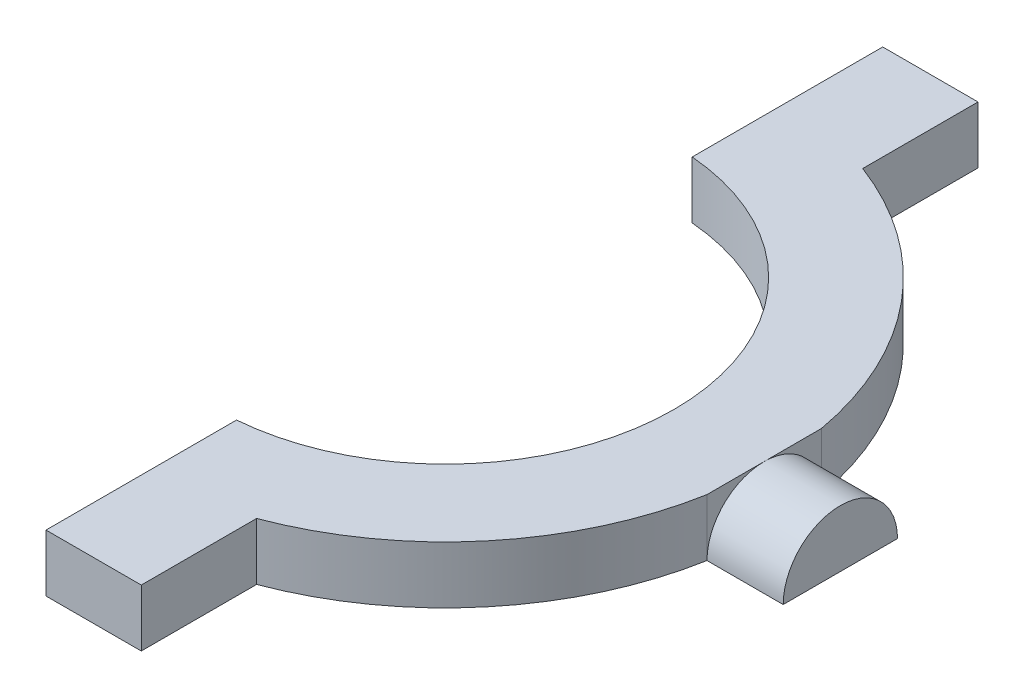
ISO-10303-21;
HEADER;
FILE_DESCRIPTION(('STEP AP214'),'2;1');
FILE_NAME('part.step','',(''),(''),'','','');
FILE_SCHEMA(('AUTOMOTIVE_DESIGN { 1 0 10303 214 1 1 1 1 }'));
ENDSEC;
DATA;
#1=APPLICATION_CONTEXT('core data for automotive mechanical design processes');
#2=APPLICATION_PROTOCOL_DEFINITION('international standard','automotive_design',2000,#1);
#3=PRODUCT_CONTEXT('',#1,'mechanical');
#4=PRODUCT('Part','Part','',(#3));
#5=PRODUCT_RELATED_PRODUCT_CATEGORY('part','',(#4));
#6=PRODUCT_DEFINITION_FORMATION('','',#4);
#7=PRODUCT_DEFINITION_CONTEXT('part definition',#1,'design');
#8=PRODUCT_DEFINITION('design','',#6,#7);
#9=PRODUCT_DEFINITION_SHAPE('','',#8);
#10=(LENGTH_UNIT() NAMED_UNIT(*) SI_UNIT(.MILLI.,.METRE.));
#11=(NAMED_UNIT(*) PLANE_ANGLE_UNIT() SI_UNIT($,.RADIAN.));
#12=(NAMED_UNIT(*) SI_UNIT($,.STERADIAN.) SOLID_ANGLE_UNIT());
#13=UNCERTAINTY_MEASURE_WITH_UNIT(LENGTH_MEASURE(1.E-05),#10,'distance_accuracy_value','');
#14=(GEOMETRIC_REPRESENTATION_CONTEXT(3) GLOBAL_UNCERTAINTY_ASSIGNED_CONTEXT((#13)) GLOBAL_UNIT_ASSIGNED_CONTEXT((#10,
#11,#12)) REPRESENTATION_CONTEXT('',''));
#15=CARTESIAN_POINT('',(0.,0.,0.));
#16=DIRECTION('',(0.,0.,1.));
#17=DIRECTION('',(1.,0.,0.));
#18=AXIS2_PLACEMENT_3D('',#15,#16,#17);
#19=CARTESIAN_POINT('',(41.466401061363,6.,6.));
#20=DIRECTION('',(-1.,0.,0.));
#21=DIRECTION('',(0.,0.,1.));
#22=AXIS2_PLACEMENT_3D('',#19,#20,#21);
#23=PLANE('',#22);
#24=CARTESIAN_POINT('',(41.466401061363,0.,0.));
#25=DIRECTION('',(1.,0.,0.));
#26=DIRECTION('',(0.,0.,-1.));
#27=AXIS2_PLACEMENT_3D('',#24,#25,#26);
#28=CIRCLE('',#27,6.);
#29=CARTESIAN_POINT('',(41.466401061363,0.,-6.));
#30=VERTEX_POINT('',#29);
#31=CARTESIAN_POINT('',(41.466401061363,0.,6.));
#32=VERTEX_POINT('',#31);
#33=EDGE_CURVE('E201',#30,#32,#28,.T.);
#34=ORIENTED_EDGE('',*,*,#33,.T.);
#35=DIRECTION('',(0.,0.,-1.));
#36=VECTOR('',#35,1.);
#37=CARTESIAN_POINT('',(41.466401061363,0.,6.));
#38=LINE('',#37,#36);
#39=EDGE_CURVE('E150',#32,#30,#38,.T.);
#40=ORIENTED_EDGE('',*,*,#39,.T.);
#41=EDGE_LOOP('',(#34,#40));
#42=FACE_BOUND('',#41,.T.);
#43=ADVANCED_FACE('F36',(#42),#23,.F.);
#44=CARTESIAN_POINT('',(0.,6.,0.));
#45=DIRECTION('',(0.,1.,0.));
#46=DIRECTION('',(0.,0.,1.));
#47=AXIS2_PLACEMENT_3D('',#44,#45,#46);
#48=PLANE('',#47);
#49=CARTESIAN_POINT('',(0.,6.,0.));
#50=DIRECTION('',(0.,1.,0.));
#51=DIRECTION('',(0.,0.,1.));
#52=AXIS2_PLACEMENT_3D('',#49,#50,#51);
#53=CIRCLE('',#52,34.);
#54=CARTESIAN_POINT('',(12.,6.,31.8119474411737));
#55=VERTEX_POINT('',#54);
#56=CARTESIAN_POINT('',(33.466401061363,6.,6.));
#57=VERTEX_POINT('',#56);
#58=EDGE_CURVE('E100',#55,#57,#53,.T.);
#59=ORIENTED_EDGE('',*,*,#58,.T.);
#60=DIRECTION('',(0.,0.,-1.));
#61=VECTOR('',#60,1.);
#62=CARTESIAN_POINT('',(33.466401061363,6.,0.));
#63=LINE('',#62,#61);
#64=CARTESIAN_POINT('',(33.466401061363,6.,0.));
#65=VERTEX_POINT('',#64);
#66=EDGE_CURVE('E144',#57,#65,#63,.T.);
#67=ORIENTED_EDGE('',*,*,#66,.T.);
#68=CARTESIAN_POINT('',(33.466401061363,6.,-5.99999999999998));
#69=VERTEX_POINT('',#68);
#70=EDGE_CURVE('E216',#65,#69,#63,.T.);
#71=ORIENTED_EDGE('',*,*,#70,.T.);
#72=CARTESIAN_POINT('',(0.,6.,0.));
#73=DIRECTION('',(0.,1.,0.));
#74=DIRECTION('',(0.,0.,1.));
#75=AXIS2_PLACEMENT_3D('',#72,#73,#74);
#76=CIRCLE('',#75,34.);
#77=CARTESIAN_POINT('',(12.,6.,-31.8119474411737));
#78=VERTEX_POINT('',#77);
#79=EDGE_CURVE('E221',#69,#78,#76,.T.);
#80=ORIENTED_EDGE('',*,*,#79,.T.);
#81=DIRECTION('',(0.,0.,-1.));
#82=VECTOR('',#81,1.);
#83=CARTESIAN_POINT('',(12.,6.,-43.9165214862028));
#84=LINE('',#83,#82);
#85=CARTESIAN_POINT('',(12.,6.,-43.9165214862028));
#86=VERTEX_POINT('',#85);
#87=EDGE_CURVE('E223',#78,#86,#84,.T.);
#88=ORIENTED_EDGE('',*,*,#87,.T.);
#89=DIRECTION('',(-1.,0.,0.));
#90=VECTOR('',#89,1.);
#91=CARTESIAN_POINT('',(1.99999999999999,6.,-43.9165214862028));
#92=LINE('',#91,#90);
#93=CARTESIAN_POINT('',(1.99999999999999,6.,-43.9165214862028));
#94=VERTEX_POINT('',#93);
#95=EDGE_CURVE('E225',#86,#94,#92,.T.);
#96=ORIENTED_EDGE('',*,*,#95,.T.);
#97=DIRECTION('',(0.,0.,1.));
#98=VECTOR('',#97,1.);
#99=CARTESIAN_POINT('',(1.99999999999999,6.,-43.9165214862028));
#100=LINE('',#99,#98);
#101=CARTESIAN_POINT('',(1.99999999999999,6.,-23.9165214862028));
#102=VERTEX_POINT('',#101);
#103=EDGE_CURVE('E122',#94,#102,#100,.T.);
#104=ORIENTED_EDGE('',*,*,#103,.T.);
#105=CARTESIAN_POINT('',(0.,6.,0.));
#106=DIRECTION('',(0.,-1.,0.));
#107=DIRECTION('',(0.,0.,1.));
#108=AXIS2_PLACEMENT_3D('',#105,#106,#107);
#109=CIRCLE('',#108,24.);
#110=CARTESIAN_POINT('',(2.,6.,23.9165214862028));
#111=VERTEX_POINT('',#110);
#112=EDGE_CURVE('E116',#102,#111,#109,.T.);
#113=ORIENTED_EDGE('',*,*,#112,.T.);
#114=DIRECTION('',(0.,0.,1.));
#115=VECTOR('',#114,1.);
#116=CARTESIAN_POINT('',(2.,6.,23.9165214862028));
#117=LINE('',#116,#115);
#118=CARTESIAN_POINT('',(2.00000000000001,6.,43.9165214862028));
#119=VERTEX_POINT('',#118);
#120=EDGE_CURVE('E120',#111,#119,#117,.T.);
#121=ORIENTED_EDGE('',*,*,#120,.T.);
#122=DIRECTION('',(1.,0.,0.));
#123=VECTOR('',#122,1.);
#124=CARTESIAN_POINT('',(2.00000000000001,6.,43.9165214862028));
#125=LINE('',#124,#123);
#126=CARTESIAN_POINT('',(12.,6.,43.9165214862028));
#127=VERTEX_POINT('',#126);
#128=EDGE_CURVE('E53',#119,#127,#125,.T.);
#129=ORIENTED_EDGE('',*,*,#128,.T.);
#130=DIRECTION('',(0.,0.,-1.));
#131=VECTOR('',#130,1.);
#132=CARTESIAN_POINT('',(12.,6.,43.9165214862028));
#133=LINE('',#132,#131);
#134=EDGE_CURVE('E167',#127,#55,#133,.T.);
#135=ORIENTED_EDGE('',*,*,#134,.T.);
#136=EDGE_LOOP('',(#59,#67,#71,#80,#88,#96,#104,#113,#121,#129,#135));
#137=FACE_BOUND('',#136,.T.);
#138=ADVANCED_FACE('F118',(#137),#48,.T.);
#139=CARTESIAN_POINT('',(12.,6.,43.9165214862028));
#140=DIRECTION('',(-1.,0.,0.));
#141=DIRECTION('',(0.,0.,1.));
#142=AXIS2_PLACEMENT_3D('',#139,#140,#141);
#143=PLANE('',#142);
#144=DIRECTION('',(0.,0.,-1.));
#145=VECTOR('',#144,1.);
#146=CARTESIAN_POINT('',(12.,0.,43.9165214862028));
#147=LINE('',#146,#145);
#148=CARTESIAN_POINT('',(12.,0.,43.9165214862028));
#149=VERTEX_POINT('',#148);
#150=CARTESIAN_POINT('',(12.,0.,31.8119474411737));
#151=VERTEX_POINT('',#150);
#152=EDGE_CURVE('E140',#149,#151,#147,.T.);
#153=ORIENTED_EDGE('',*,*,#152,.T.);
#154=DIRECTION('',(0.,-1.,0.));
#155=VECTOR('',#154,1.);
#156=CARTESIAN_POINT('',(12.,6.,31.8119474411737));
#157=LINE('',#156,#155);
#158=EDGE_CURVE('E12',#55,#151,#157,.T.);
#159=ORIENTED_EDGE('',*,*,#158,.F.);
#160=ORIENTED_EDGE('',*,*,#134,.F.);
#161=DIRECTION('',(0.,-1.,0.));
#162=VECTOR('',#161,1.);
#163=CARTESIAN_POINT('',(12.,6.,43.9165214862028));
#164=LINE('',#163,#162);
#165=EDGE_CURVE('E136',#127,#149,#164,.T.);
#166=ORIENTED_EDGE('',*,*,#165,.T.);
#167=EDGE_LOOP('',(#153,#159,#160,#166));
#168=FACE_BOUND('',#167,.T.);
#169=ADVANCED_FACE('F38',(#168),#143,.F.);
#170=CARTESIAN_POINT('',(0.,6.,0.));
#171=DIRECTION('',(0.,-1.,0.));
#172=DIRECTION('',(0.,0.,-1.));
#173=AXIS2_PLACEMENT_3D('',#170,#171,#172);
#174=CYLINDRICAL_SURFACE('',#173,34.);
#175=CARTESIAN_POINT('',(0.,0.,0.));
#176=DIRECTION('',(0.,1.,0.));
#177=DIRECTION('',(0.,0.,1.));
#178=AXIS2_PLACEMENT_3D('',#175,#176,#177);
#179=CIRCLE('',#178,34.);
#180=CARTESIAN_POINT('',(33.466401061363,0.,6.));
#181=VERTEX_POINT('',#180);
#182=EDGE_CURVE('E143',#151,#181,#179,.T.);
#183=ORIENTED_EDGE('',*,*,#182,.T.);
#184=DIRECTION('',(0.,-1.,0.));
#185=VECTOR('',#184,1.);
#186=CARTESIAN_POINT('',(33.466401061363,6.,6.));
#187=LINE('',#186,#185);
#188=EDGE_CURVE('E45',#57,#181,#187,.T.);
#189=ORIENTED_EDGE('',*,*,#188,.F.);
#190=ORIENTED_EDGE('',*,*,#58,.F.);
#191=ORIENTED_EDGE('',*,*,#158,.T.);
#192=EDGE_LOOP('',(#183,#189,#190,#191));
#193=FACE_BOUND('',#192,.T.);
#194=ADVANCED_FACE('F203',(#193),#174,.T.);
#195=CARTESIAN_POINT('',(0.,6.,0.));
#196=DIRECTION('',(0.,-1.,0.));
#197=DIRECTION('',(0.,0.,-1.));
#198=AXIS2_PLACEMENT_3D('',#195,#196,#197);
#199=CYLINDRICAL_SURFACE('',#198,34.);
#200=CARTESIAN_POINT('',(0.,0.,0.));
#201=DIRECTION('',(0.,1.,0.));
#202=DIRECTION('',(0.,0.,1.));
#203=AXIS2_PLACEMENT_3D('',#200,#201,#202);
#204=CIRCLE('',#203,34.);
#205=CARTESIAN_POINT('',(33.466401061363,0.,-6.));
#206=VERTEX_POINT('',#205);
#207=CARTESIAN_POINT('',(12.,0.,-31.8119474411737));
#208=VERTEX_POINT('',#207);
#209=EDGE_CURVE('E156',#206,#208,#204,.T.);
#210=ORIENTED_EDGE('',*,*,#209,.T.);
#211=DIRECTION('',(0.,-1.,0.));
#212=VECTOR('',#211,1.);
#213=CARTESIAN_POINT('',(12.,6.,-31.8119474411737));
#214=LINE('',#213,#212);
#215=EDGE_CURVE('E177',#78,#208,#214,.T.);
#216=ORIENTED_EDGE('',*,*,#215,.F.);
#217=ORIENTED_EDGE('',*,*,#79,.F.);
#218=DIRECTION('',(0.,-1.,0.));
#219=VECTOR('',#218,1.);
#220=CARTESIAN_POINT('',(33.466401061363,6.,-6.));
#221=LINE('',#220,#219);
#222=EDGE_CURVE('E180',#69,#206,#221,.T.);
#223=ORIENTED_EDGE('',*,*,#222,.T.);
#224=EDGE_LOOP('',(#210,#216,#217,#223));
#225=FACE_BOUND('',#224,.T.);
#226=ADVANCED_FACE('F254',(#225),#199,.T.);
#227=CARTESIAN_POINT('',(12.,6.,-43.9165214862028));
#228=DIRECTION('',(-1.,0.,0.));
#229=DIRECTION('',(0.,0.,1.));
#230=AXIS2_PLACEMENT_3D('',#227,#228,#229);
#231=PLANE('',#230);
#232=DIRECTION('',(0.,0.,-1.));
#233=VECTOR('',#232,1.);
#234=CARTESIAN_POINT('',(12.,0.,-43.9165214862028));
#235=LINE('',#234,#233);
#236=CARTESIAN_POINT('',(12.,0.,-43.9165214862028));
#237=VERTEX_POINT('',#236);
#238=EDGE_CURVE('E158',#208,#237,#235,.T.);
#239=ORIENTED_EDGE('',*,*,#238,.T.);
#240=DIRECTION('',(0.,-1.,0.));
#241=VECTOR('',#240,1.);
#242=CARTESIAN_POINT('',(12.,6.,-43.9165214862028));
#243=LINE('',#242,#241);
#244=EDGE_CURVE('E174',#86,#237,#243,.T.);
#245=ORIENTED_EDGE('',*,*,#244,.F.);
#246=ORIENTED_EDGE('',*,*,#87,.F.);
#247=ORIENTED_EDGE('',*,*,#215,.T.);
#248=EDGE_LOOP('',(#239,#245,#246,#247));
#249=FACE_BOUND('',#248,.T.);
#250=ADVANCED_FACE('F261',(#249),#231,.F.);
#251=CARTESIAN_POINT('',(1.99999999999999,6.,-43.9165214862028));
#252=DIRECTION('',(0.,0.,1.));
#253=DIRECTION('',(1.,0.,0.));
#254=AXIS2_PLACEMENT_3D('',#251,#252,#253);
#255=PLANE('',#254);
#256=DIRECTION('',(-1.,0.,0.));
#257=VECTOR('',#256,1.);
#258=CARTESIAN_POINT('',(1.99999999999999,0.,-43.9165214862028));
#259=LINE('',#258,#257);
#260=CARTESIAN_POINT('',(1.99999999999999,0.,-43.9165214862028));
#261=VERTEX_POINT('',#260);
#262=EDGE_CURVE('E160',#237,#261,#259,.T.);
#263=ORIENTED_EDGE('',*,*,#262,.T.);
#264=DIRECTION('',(0.,-1.,0.));
#265=VECTOR('',#264,1.);
#266=CARTESIAN_POINT('',(1.99999999999999,6.,-43.9165214862028));
#267=LINE('',#266,#265);
#268=EDGE_CURVE('E171',#94,#261,#267,.T.);
#269=ORIENTED_EDGE('',*,*,#268,.F.);
#270=ORIENTED_EDGE('',*,*,#95,.F.);
#271=ORIENTED_EDGE('',*,*,#244,.T.);
#272=EDGE_LOOP('',(#263,#269,#270,#271));
#273=FACE_BOUND('',#272,.T.);
#274=ADVANCED_FACE('F231',(#273),#255,.F.);
#275=CARTESIAN_POINT('',(1.99999999999999,6.,-43.9165214862028));
#276=DIRECTION('',(1.,0.,0.));
#277=DIRECTION('',(0.,0.,-1.));
#278=AXIS2_PLACEMENT_3D('',#275,#276,#277);
#279=PLANE('',#278);
#280=DIRECTION('',(0.,0.,1.));
#281=VECTOR('',#280,1.);
#282=CARTESIAN_POINT('',(1.99999999999999,0.,-43.9165214862028));
#283=LINE('',#282,#281);
#284=CARTESIAN_POINT('',(1.99999999999999,0.,-23.9165214862028));
#285=VERTEX_POINT('',#284);
#286=EDGE_CURVE('E162',#261,#285,#283,.T.);
#287=ORIENTED_EDGE('',*,*,#286,.T.);
#288=DIRECTION('',(0.,-1.,0.));
#289=VECTOR('',#288,1.);
#290=CARTESIAN_POINT('',(1.99999999999999,6.,-23.9165214862028));
#291=LINE('',#290,#289);
#292=EDGE_CURVE('E131',#102,#285,#291,.T.);
#293=ORIENTED_EDGE('',*,*,#292,.F.);
#294=ORIENTED_EDGE('',*,*,#103,.F.);
#295=ORIENTED_EDGE('',*,*,#268,.T.);
#296=EDGE_LOOP('',(#287,#293,#294,#295));
#297=FACE_BOUND('',#296,.T.);
#298=ADVANCED_FACE('F235',(#297),#279,.F.);
#299=CARTESIAN_POINT('',(0.,6.,0.));
#300=DIRECTION('',(0.,-1.,0.));
#301=DIRECTION('',(0.,0.,-1.));
#302=AXIS2_PLACEMENT_3D('',#299,#300,#301);
#303=CYLINDRICAL_SURFACE('',#302,24.);
#304=CARTESIAN_POINT('',(0.,0.,0.));
#305=DIRECTION('',(0.,-1.,0.));
#306=DIRECTION('',(0.,0.,1.));
#307=AXIS2_PLACEMENT_3D('',#304,#305,#306);
#308=CIRCLE('',#307,24.);
#309=CARTESIAN_POINT('',(2.,0.,23.9165214862028));
#310=VERTEX_POINT('',#309);
#311=EDGE_CURVE('E130',#285,#310,#308,.T.);
#312=ORIENTED_EDGE('',*,*,#311,.T.);
#313=DIRECTION('',(0.,-1.,0.));
#314=VECTOR('',#313,1.);
#315=CARTESIAN_POINT('',(2.,6.,23.9165214862028));
#316=LINE('',#315,#314);
#317=EDGE_CURVE('E127',#111,#310,#316,.T.);
#318=ORIENTED_EDGE('',*,*,#317,.F.);
#319=ORIENTED_EDGE('',*,*,#112,.F.);
#320=ORIENTED_EDGE('',*,*,#292,.T.);
#321=EDGE_LOOP('',(#312,#318,#319,#320));
#322=FACE_BOUND('',#321,.T.);
#323=ADVANCED_FACE('F128',(#322),#303,.F.);
#324=CARTESIAN_POINT('',(2.,6.,23.9165214862028));
#325=DIRECTION('',(1.,0.,0.));
#326=DIRECTION('',(0.,0.,-1.));
#327=AXIS2_PLACEMENT_3D('',#324,#325,#326);
#328=PLANE('',#327);
#329=DIRECTION('',(0.,0.,1.));
#330=VECTOR('',#329,1.);
#331=CARTESIAN_POINT('',(2.,0.,23.9165214862028));
#332=LINE('',#331,#330);
#333=CARTESIAN_POINT('',(2.00000000000001,0.,43.9165214862028));
#334=VERTEX_POINT('',#333);
#335=EDGE_CURVE('E86',#310,#334,#332,.T.);
#336=ORIENTED_EDGE('',*,*,#335,.T.);
#337=DIRECTION('',(0.,-1.,0.));
#338=VECTOR('',#337,1.);
#339=CARTESIAN_POINT('',(2.00000000000001,6.,43.9165214862028));
#340=LINE('',#339,#338);
#341=EDGE_CURVE('E132',#119,#334,#340,.T.);
#342=ORIENTED_EDGE('',*,*,#341,.F.);
#343=ORIENTED_EDGE('',*,*,#120,.F.);
#344=ORIENTED_EDGE('',*,*,#317,.T.);
#345=EDGE_LOOP('',(#336,#342,#343,#344));
#346=FACE_BOUND('',#345,.T.);
#347=ADVANCED_FACE('F134',(#346),#328,.F.);
#348=CARTESIAN_POINT('',(2.00000000000001,6.,43.9165214862028));
#349=DIRECTION('',(0.,0.,-1.));
#350=DIRECTION('',(-1.,0.,0.));
#351=AXIS2_PLACEMENT_3D('',#348,#349,#350);
#352=PLANE('',#351);
#353=DIRECTION('',(1.,0.,0.));
#354=VECTOR('',#353,1.);
#355=CARTESIAN_POINT('',(2.00000000000001,0.,43.9165214862028));
#356=LINE('',#355,#354);
#357=EDGE_CURVE('E92',#334,#149,#356,.T.);
#358=ORIENTED_EDGE('',*,*,#357,.T.);
#359=ORIENTED_EDGE('',*,*,#165,.F.);
#360=ORIENTED_EDGE('',*,*,#128,.F.);
#361=ORIENTED_EDGE('',*,*,#341,.T.);
#362=EDGE_LOOP('',(#358,#359,#360,#361));
#363=FACE_BOUND('',#362,.T.);
#364=ADVANCED_FACE('F238',(#363),#352,.F.);
#365=CARTESIAN_POINT('',(0.,0.,0.));
#366=DIRECTION('',(0.,1.,0.));
#367=DIRECTION('',(0.,0.,1.));
#368=AXIS2_PLACEMENT_3D('',#365,#366,#367);
#369=PLANE('',#368);
#370=DIRECTION('',(1.,0.,0.));
#371=VECTOR('',#370,1.);
#372=CARTESIAN_POINT('',(33.466401061363,0.,6.));
#373=LINE('',#372,#371);
#374=EDGE_CURVE('E147',#181,#32,#373,.T.);
#375=ORIENTED_EDGE('',*,*,#374,.F.);
#376=ORIENTED_EDGE('',*,*,#182,.F.);
#377=ORIENTED_EDGE('',*,*,#152,.F.);
#378=ORIENTED_EDGE('',*,*,#357,.F.);
#379=ORIENTED_EDGE('',*,*,#335,.F.);
#380=ORIENTED_EDGE('',*,*,#311,.F.);
#381=ORIENTED_EDGE('',*,*,#286,.F.);
#382=ORIENTED_EDGE('',*,*,#262,.F.);
#383=ORIENTED_EDGE('',*,*,#238,.F.);
#384=ORIENTED_EDGE('',*,*,#209,.F.);
#385=DIRECTION('',(-1.,0.,0.));
#386=VECTOR('',#385,1.);
#387=CARTESIAN_POINT('',(33.466401061363,0.,-6.));
#388=LINE('',#387,#386);
#389=EDGE_CURVE('E153',#30,#206,#388,.T.);
#390=ORIENTED_EDGE('',*,*,#389,.F.);
#391=ORIENTED_EDGE('',*,*,#39,.F.);
#392=EDGE_LOOP('',(#375,#376,#377,#378,#379,#380,#381,#382,#383,#384,#390,#391));
#393=FACE_BOUND('',#392,.T.);
#394=ADVANCED_FACE('F207',(#393),#369,.F.);
#395=CARTESIAN_POINT('',(33.466401061363,3.,0.));
#396=DIRECTION('',(1.,0.,0.));
#397=DIRECTION('',(0.,0.,-1.));
#398=AXIS2_PLACEMENT_3D('',#395,#396,#397);
#399=PLANE('',#398);
#400=ORIENTED_EDGE('',*,*,#188,.T.);
#401=CARTESIAN_POINT('',(33.466401061363,0.,0.));
#402=DIRECTION('',(1.,0.,0.));
#403=DIRECTION('',(0.,0.,-1.));
#404=AXIS2_PLACEMENT_3D('',#401,#402,#403);
#405=CIRCLE('',#404,6.);
#406=EDGE_CURVE('E190',#65,#181,#405,.T.);
#407=ORIENTED_EDGE('',*,*,#406,.F.);
#408=ORIENTED_EDGE('',*,*,#66,.F.);
#409=EDGE_LOOP('',(#400,#407,#408));
#410=FACE_BOUND('',#409,.T.);
#411=ADVANCED_FACE('F188',(#410),#399,.T.);
#412=ORIENTED_EDGE('',*,*,#222,.F.);
#413=ORIENTED_EDGE('',*,*,#70,.F.);
#414=EDGE_CURVE('E200',#206,#65,#405,.T.);
#415=ORIENTED_EDGE('',*,*,#414,.F.);
#416=EDGE_LOOP('',(#412,#413,#415));
#417=FACE_BOUND('',#416,.T.);
#418=ADVANCED_FACE('F300',(#417),#399,.T.);
#419=CARTESIAN_POINT('',(33.466401061363,0.,0.));
#420=DIRECTION('',(1.,0.,0.));
#421=DIRECTION('',(0.,0.,-1.));
#422=AXIS2_PLACEMENT_3D('',#419,#420,#421);
#423=CYLINDRICAL_SURFACE('',#422,6.);
#424=ORIENTED_EDGE('',*,*,#414,.T.);
#425=ORIENTED_EDGE('',*,*,#406,.T.);
#426=ORIENTED_EDGE('',*,*,#374,.T.);
#427=ORIENTED_EDGE('',*,*,#33,.F.);
#428=ORIENTED_EDGE('',*,*,#389,.T.);
#429=EDGE_LOOP('',(#424,#425,#426,#427,#428));
#430=FACE_BOUND('',#429,.T.);
#431=ADVANCED_FACE('F196',(#430),#423,.T.);
#432=CLOSED_SHELL('',(#43,#138,#169,#194,#226,#250,#274,#298,#323,#347,#364,#394,#411,#418,#431));
#433=MANIFOLD_SOLID_BREP('B2',#432);
#434=ADVANCED_BREP_SHAPE_REPRESENTATION('',(#18,#433),#14);
#435=SHAPE_DEFINITION_REPRESENTATION(#9,#434);
ENDSEC;
END-ISO-10303-21;
